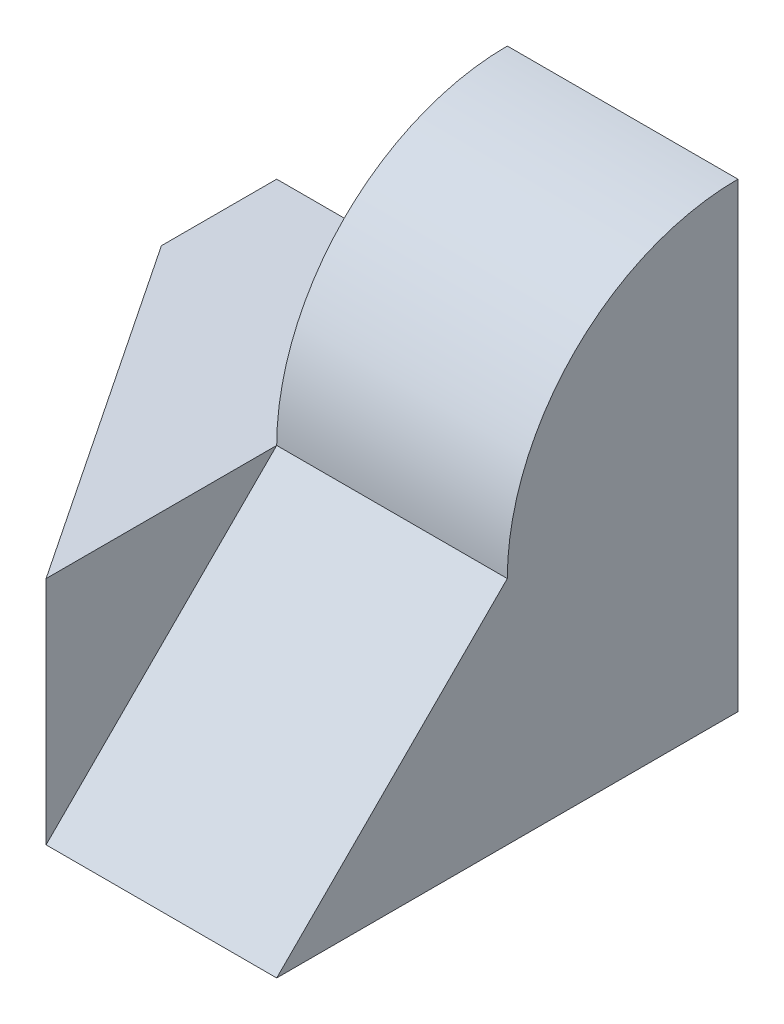
ISO-10303-21;
HEADER;
FILE_DESCRIPTION(('STEP AP214'),'2;1');
FILE_NAME('part.step','',(''),(''),'','','');
FILE_SCHEMA(('AUTOMOTIVE_DESIGN { 1 0 10303 214 1 1 1 1 }'));
ENDSEC;
DATA;
#1=APPLICATION_CONTEXT('core data for automotive mechanical design processes');
#2=APPLICATION_PROTOCOL_DEFINITION('international standard','automotive_design',2000,#1);
#3=PRODUCT_CONTEXT('',#1,'mechanical');
#4=PRODUCT('Part','Part','',(#3));
#5=PRODUCT_RELATED_PRODUCT_CATEGORY('part','',(#4));
#6=PRODUCT_DEFINITION_FORMATION('','',#4);
#7=PRODUCT_DEFINITION_CONTEXT('part definition',#1,'design');
#8=PRODUCT_DEFINITION('design','',#6,#7);
#9=PRODUCT_DEFINITION_SHAPE('','',#8);
#10=(LENGTH_UNIT() NAMED_UNIT(*) SI_UNIT(.MILLI.,.METRE.));
#11=(NAMED_UNIT(*) PLANE_ANGLE_UNIT() SI_UNIT($,.RADIAN.));
#12=(NAMED_UNIT(*) SI_UNIT($,.STERADIAN.) SOLID_ANGLE_UNIT());
#13=UNCERTAINTY_MEASURE_WITH_UNIT(LENGTH_MEASURE(1.E-05),#10,'distance_accuracy_value','');
#14=(GEOMETRIC_REPRESENTATION_CONTEXT(3) GLOBAL_UNCERTAINTY_ASSIGNED_CONTEXT((#13)) GLOBAL_UNIT_ASSIGNED_CONTEXT((#10,
#11,#12)) REPRESENTATION_CONTEXT('',''));
#15=CARTESIAN_POINT('',(0.,0.,0.));
#16=DIRECTION('',(0.,0.,1.));
#17=DIRECTION('',(1.,0.,0.));
#18=AXIS2_PLACEMENT_3D('',#15,#16,#17);
#19=CARTESIAN_POINT('',(-20.,20.,40.));
#20=DIRECTION('',(0.,-1.,0.));
#21=DIRECTION('',(1.,0.,0.));
#22=AXIS2_PLACEMENT_3D('',#19,#20,#21);
#23=PLANE('',#22);
#24=DIRECTION('',(0.,0.,1.));
#25=VECTOR('',#24,1.);
#26=CARTESIAN_POINT('',(-20.,20.,40.));
#27=LINE('',#26,#25);
#28=CARTESIAN_POINT('',(-20.,20.,20.));
#29=VERTEX_POINT('',#28);
#30=CARTESIAN_POINT('',(-20.,20.,40.));
#31=VERTEX_POINT('',#30);
#32=EDGE_CURVE('E95',#29,#31,#27,.T.);
#33=ORIENTED_EDGE('',*,*,#32,.F.);
#34=DIRECTION('',(0.,0.,-1.));
#35=VECTOR('',#34,1.);
#36=CARTESIAN_POINT('',(-20.,20.,40.));
#37=LINE('',#36,#35);
#38=CARTESIAN_POINT('',(-20.,20.,0.));
#39=VERTEX_POINT('',#38);
#40=EDGE_CURVE('E136',#29,#39,#37,.T.);
#41=ORIENTED_EDGE('',*,*,#40,.T.);
#42=DIRECTION('',(-1.,0.,0.));
#43=VECTOR('',#42,1.);
#44=CARTESIAN_POINT('',(-20.,20.,0.));
#45=LINE('',#44,#43);
#46=CARTESIAN_POINT('',(-40.,20.,0.));
#47=VERTEX_POINT('',#46);
#48=EDGE_CURVE('E118',#39,#47,#45,.T.);
#49=ORIENTED_EDGE('',*,*,#48,.T.);
#50=DIRECTION('',(0.,0.,-1.));
#51=VECTOR('',#50,1.);
#52=CARTESIAN_POINT('',(-40.,20.,40.));
#53=LINE('',#52,#51);
#54=CARTESIAN_POINT('',(-40.,20.,9.99999999999998));
#55=VERTEX_POINT('',#54);
#56=EDGE_CURVE('E55',#55,#47,#53,.T.);
#57=ORIENTED_EDGE('',*,*,#56,.F.);
#58=DIRECTION('',(-0.554700196225229,0.,-0.832050294337844));
#59=VECTOR('',#58,1.);
#60=CARTESIAN_POINT('',(-32.3076923076923,20.,21.5384615384615));
#61=LINE('',#60,#59);
#62=EDGE_CURVE('E106',#31,#55,#61,.T.);
#63=ORIENTED_EDGE('',*,*,#62,.F.);
#64=EDGE_LOOP('',(#33,#41,#49,#57,#63));
#65=FACE_BOUND('',#64,.T.);
#66=ADVANCED_FACE('F33',(#65),#23,.F.);
#67=CARTESIAN_POINT('',(-40.,0.,40.));
#68=DIRECTION('',(0.,1.,0.));
#69=DIRECTION('',(0.,0.,1.));
#70=AXIS2_PLACEMENT_3D('',#67,#68,#69);
#71=PLANE('',#70);
#72=DIRECTION('',(1.,0.,0.));
#73=VECTOR('',#72,1.);
#74=CARTESIAN_POINT('',(-40.,0.,40.));
#75=LINE('',#74,#73);
#76=CARTESIAN_POINT('',(-20.,0.,40.));
#77=VERTEX_POINT('',#76);
#78=CARTESIAN_POINT('',(0.,0.,40.));
#79=VERTEX_POINT('',#78);
#80=EDGE_CURVE('E102',#77,#79,#75,.T.);
#81=ORIENTED_EDGE('',*,*,#80,.F.);
#82=DIRECTION('',(-0.554700196225229,0.,-0.832050294337844));
#83=VECTOR('',#82,1.);
#84=CARTESIAN_POINT('',(-26.1538461538462,0.,30.7692307692308));
#85=LINE('',#84,#83);
#86=CARTESIAN_POINT('',(-40.,0.,9.99999999999998));
#87=VERTEX_POINT('',#86);
#88=EDGE_CURVE('E108',#77,#87,#85,.T.);
#89=ORIENTED_EDGE('',*,*,#88,.T.);
#90=DIRECTION('',(0.,0.,-1.));
#91=VECTOR('',#90,1.);
#92=CARTESIAN_POINT('',(-40.,0.,40.));
#93=LINE('',#92,#91);
#94=CARTESIAN_POINT('',(-40.,0.,0.));
#95=VERTEX_POINT('',#94);
#96=EDGE_CURVE('E48',#87,#95,#93,.T.);
#97=ORIENTED_EDGE('',*,*,#96,.T.);
#98=DIRECTION('',(1.,0.,0.));
#99=VECTOR('',#98,1.);
#100=CARTESIAN_POINT('',(-40.,0.,0.));
#101=LINE('',#100,#99);
#102=CARTESIAN_POINT('',(0.,0.,0.));
#103=VERTEX_POINT('',#102);
#104=EDGE_CURVE('E124',#95,#103,#101,.T.);
#105=ORIENTED_EDGE('',*,*,#104,.T.);
#106=DIRECTION('',(0.,0.,-1.));
#107=VECTOR('',#106,1.);
#108=CARTESIAN_POINT('',(0.,0.,40.));
#109=LINE('',#108,#107);
#110=EDGE_CURVE('E41',#79,#103,#109,.T.);
#111=ORIENTED_EDGE('',*,*,#110,.F.);
#112=EDGE_LOOP('',(#81,#89,#97,#105,#111));
#113=FACE_BOUND('',#112,.T.);
#114=ADVANCED_FACE('F35',(#113),#71,.F.);
#115=CARTESIAN_POINT('',(0.,0.,40.));
#116=DIRECTION('',(-1.,0.,0.));
#117=DIRECTION('',(0.,0.,1.));
#118=AXIS2_PLACEMENT_3D('',#115,#116,#117);
#119=PLANE('',#118);
#120=CARTESIAN_POINT('',(0.,20.,0.));
#121=DIRECTION('',(-1.,0.,0.));
#122=DIRECTION('',(0.,0.,1.));
#123=AXIS2_PLACEMENT_3D('',#120,#121,#122);
#124=CIRCLE('',#123,20.);
#125=CARTESIAN_POINT('',(0.,40.,0.));
#126=VERTEX_POINT('',#125);
#127=CARTESIAN_POINT('',(0.,20.,20.));
#128=VERTEX_POINT('',#127);
#129=EDGE_CURVE('E122',#126,#128,#124,.F.);
#130=ORIENTED_EDGE('',*,*,#129,.T.);
#131=DIRECTION('',(0.,0.707106781186548,-0.707106781186547));
#132=VECTOR('',#131,1.);
#133=CARTESIAN_POINT('',(0.,20.,20.));
#134=LINE('',#133,#132);
#135=EDGE_CURVE('E141',#79,#128,#134,.T.);
#136=ORIENTED_EDGE('',*,*,#135,.F.);
#137=ORIENTED_EDGE('',*,*,#110,.T.);
#138=DIRECTION('',(0.,1.,0.));
#139=VECTOR('',#138,1.);
#140=CARTESIAN_POINT('',(0.,0.,0.));
#141=LINE('',#140,#139);
#142=EDGE_CURVE('E126',#103,#126,#141,.T.);
#143=ORIENTED_EDGE('',*,*,#142,.T.);
#144=EDGE_LOOP('',(#130,#136,#137,#143));
#145=FACE_BOUND('',#144,.T.);
#146=ADVANCED_FACE('F139',(#145),#119,.F.);
#147=CARTESIAN_POINT('',(-20.,40.,40.));
#148=DIRECTION('',(1.,0.,0.));
#149=DIRECTION('',(0.,0.,-1.));
#150=AXIS2_PLACEMENT_3D('',#147,#148,#149);
#151=PLANE('',#150);
#152=ORIENTED_EDGE('',*,*,#40,.F.);
#153=CARTESIAN_POINT('',(-20.,20.,0.));
#154=DIRECTION('',(-1.,0.,0.));
#155=DIRECTION('',(0.,0.,1.));
#156=AXIS2_PLACEMENT_3D('',#153,#154,#155);
#157=CIRCLE('',#156,20.);
#158=CARTESIAN_POINT('',(-20.,40.,0.));
#159=VERTEX_POINT('',#158);
#160=EDGE_CURVE('E111',#159,#29,#157,.F.);
#161=ORIENTED_EDGE('',*,*,#160,.F.);
#162=DIRECTION('',(0.,-1.,0.));
#163=VECTOR('',#162,1.);
#164=CARTESIAN_POINT('',(-20.,40.,0.));
#165=LINE('',#164,#163);
#166=EDGE_CURVE('E131',#159,#39,#165,.T.);
#167=ORIENTED_EDGE('',*,*,#166,.T.);
#168=EDGE_LOOP('',(#152,#161,#167));
#169=FACE_BOUND('',#168,.T.);
#170=ADVANCED_FACE('F154',(#169),#151,.F.);
#171=CARTESIAN_POINT('',(-40.,20.,40.));
#172=DIRECTION('',(1.,0.,0.));
#173=DIRECTION('',(0.,0.,-1.));
#174=AXIS2_PLACEMENT_3D('',#171,#172,#173);
#175=PLANE('',#174);
#176=ORIENTED_EDGE('',*,*,#96,.F.);
#177=DIRECTION('',(0.,1.,0.));
#178=VECTOR('',#177,1.);
#179=CARTESIAN_POINT('',(-40.,-20.,9.99999999999998));
#180=LINE('',#179,#178);
#181=EDGE_CURVE('E110',#87,#55,#180,.T.);
#182=ORIENTED_EDGE('',*,*,#181,.T.);
#183=ORIENTED_EDGE('',*,*,#56,.T.);
#184=DIRECTION('',(0.,-1.,0.));
#185=VECTOR('',#184,1.);
#186=CARTESIAN_POINT('',(-40.,20.,0.));
#187=LINE('',#186,#185);
#188=EDGE_CURVE('E115',#47,#95,#187,.T.);
#189=ORIENTED_EDGE('',*,*,#188,.T.);
#190=EDGE_LOOP('',(#176,#182,#183,#189));
#191=FACE_BOUND('',#190,.T.);
#192=ADVANCED_FACE('F161',(#191),#175,.F.);
#193=CARTESIAN_POINT('',(0.,0.,0.));
#194=DIRECTION('',(0.,0.,1.));
#195=DIRECTION('',(1.,0.,0.));
#196=AXIS2_PLACEMENT_3D('',#193,#194,#195);
#197=PLANE('',#196);
#198=ORIENTED_EDGE('',*,*,#104,.F.);
#199=ORIENTED_EDGE('',*,*,#188,.F.);
#200=ORIENTED_EDGE('',*,*,#48,.F.);
#201=ORIENTED_EDGE('',*,*,#166,.F.);
#202=DIRECTION('',(-1.,0.,0.));
#203=VECTOR('',#202,1.);
#204=CARTESIAN_POINT('',(0.,40.,0.));
#205=LINE('',#204,#203);
#206=EDGE_CURVE('E129',#126,#159,#205,.T.);
#207=ORIENTED_EDGE('',*,*,#206,.F.);
#208=ORIENTED_EDGE('',*,*,#142,.F.);
#209=EDGE_LOOP('',(#198,#199,#200,#201,#207,#208));
#210=FACE_BOUND('',#209,.T.);
#211=ADVANCED_FACE('F145',(#210),#197,.F.);
#212=CARTESIAN_POINT('',(20.,20.,0.));
#213=DIRECTION('',(-1.,0.,0.));
#214=DIRECTION('',(0.,0.,1.));
#215=AXIS2_PLACEMENT_3D('',#212,#213,#214);
#216=CYLINDRICAL_SURFACE('',#215,20.);
#217=ORIENTED_EDGE('',*,*,#206,.T.);
#218=ORIENTED_EDGE('',*,*,#160,.T.);
#219=DIRECTION('',(-1.,0.,0.));
#220=VECTOR('',#219,1.);
#221=CARTESIAN_POINT('',(20.,20.,20.));
#222=LINE('',#221,#220);
#223=EDGE_CURVE('E105',#128,#29,#222,.T.);
#224=ORIENTED_EDGE('',*,*,#223,.F.);
#225=ORIENTED_EDGE('',*,*,#129,.F.);
#226=EDGE_LOOP('',(#217,#218,#224,#225));
#227=FACE_BOUND('',#226,.T.);
#228=ADVANCED_FACE('F151',(#227),#216,.T.);
#229=CARTESIAN_POINT('',(-32.3076923076923,-20.,21.5384615384615));
#230=DIRECTION('',(0.832050294337844,0.,-0.554700196225229));
#231=DIRECTION('',(-0.554700196225229,0.,-0.832050294337844));
#232=AXIS2_PLACEMENT_3D('',#229,#230,#231);
#233=PLANE('',#232);
#234=DIRECTION('',(0.,1.,0.));
#235=VECTOR('',#234,1.);
#236=CARTESIAN_POINT('',(-20.,0.,40.));
#237=LINE('',#236,#235);
#238=EDGE_CURVE('E11',#77,#31,#237,.T.);
#239=ORIENTED_EDGE('',*,*,#238,.T.);
#240=ORIENTED_EDGE('',*,*,#62,.T.);
#241=ORIENTED_EDGE('',*,*,#181,.F.);
#242=ORIENTED_EDGE('',*,*,#88,.F.);
#243=EDGE_LOOP('',(#239,#240,#241,#242));
#244=FACE_BOUND('',#243,.T.);
#245=ADVANCED_FACE('F109',(#244),#233,.F.);
#246=CARTESIAN_POINT('',(-20.,20.,20.));
#247=DIRECTION('',(0.,-0.707106781186547,-0.707106781186548));
#248=DIRECTION('',(0.,0.707106781186548,-0.707106781186547));
#249=AXIS2_PLACEMENT_3D('',#246,#247,#248);
#250=PLANE('',#249);
#251=ORIENTED_EDGE('',*,*,#135,.T.);
#252=ORIENTED_EDGE('',*,*,#223,.T.);
#253=DIRECTION('',(0.,0.707106781186548,-0.707106781186547));
#254=VECTOR('',#253,1.);
#255=CARTESIAN_POINT('',(-20.,20.,20.));
#256=LINE('',#255,#254);
#257=EDGE_CURVE('E93',#77,#29,#256,.T.);
#258=ORIENTED_EDGE('',*,*,#257,.F.);
#259=ORIENTED_EDGE('',*,*,#80,.T.);
#260=EDGE_LOOP('',(#251,#252,#258,#259));
#261=FACE_BOUND('',#260,.T.);
#262=ADVANCED_FACE('F100',(#261),#250,.F.);
#263=CARTESIAN_POINT('',(-20.,0.,0.));
#264=DIRECTION('',(1.,0.,0.));
#265=DIRECTION('',(0.,0.,-1.));
#266=AXIS2_PLACEMENT_3D('',#263,#264,#265);
#267=PLANE('',#266);
#268=ORIENTED_EDGE('',*,*,#32,.T.);
#269=ORIENTED_EDGE('',*,*,#238,.F.);
#270=ORIENTED_EDGE('',*,*,#257,.T.);
#271=EDGE_LOOP('',(#268,#269,#270));
#272=FACE_BOUND('',#271,.T.);
#273=ADVANCED_FACE('F92',(#272),#267,.T.);
#274=CLOSED_SHELL('',(#66,#114,#146,#170,#192,#211,#228,#245,#262,#273));
#275=MANIFOLD_SOLID_BREP('B2',#274);
#276=ADVANCED_BREP_SHAPE_REPRESENTATION('',(#18,#275),#14);
#277=SHAPE_DEFINITION_REPRESENTATION(#9,#276);
ENDSEC;
END-ISO-10303-21;
